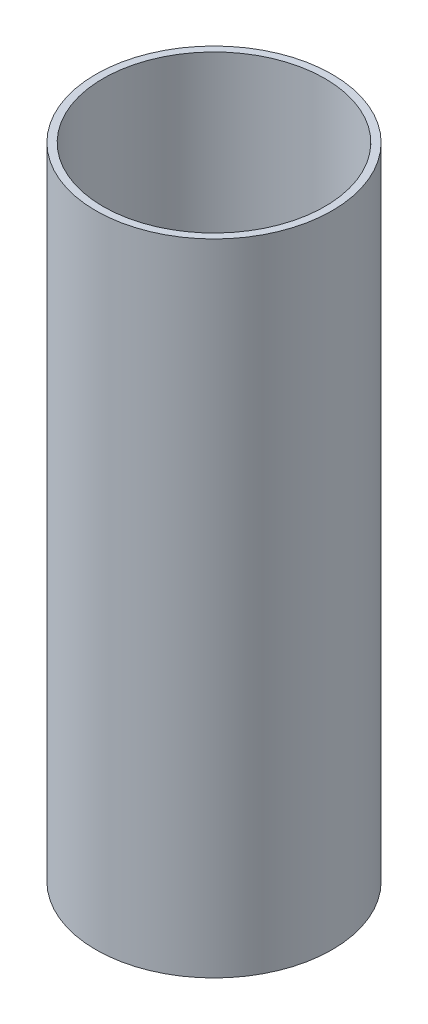
ISO-10303-21;
HEADER;
FILE_DESCRIPTION(('STEP AP214'),'2;1');
FILE_NAME('part.step','',(''),(''),'','','');
FILE_SCHEMA(('AUTOMOTIVE_DESIGN { 1 0 10303 214 1 1 1 1 }'));
ENDSEC;
DATA;
#1=APPLICATION_CONTEXT('core data for automotive mechanical design processes');
#2=APPLICATION_PROTOCOL_DEFINITION('international standard','automotive_design',2000,#1);
#3=PRODUCT_CONTEXT('',#1,'mechanical');
#4=PRODUCT('Part','Part','',(#3));
#5=PRODUCT_RELATED_PRODUCT_CATEGORY('part','',(#4));
#6=PRODUCT_DEFINITION_FORMATION('','',#4);
#7=PRODUCT_DEFINITION_CONTEXT('part definition',#1,'design');
#8=PRODUCT_DEFINITION('design','',#6,#7);
#9=PRODUCT_DEFINITION_SHAPE('','',#8);
#10=(LENGTH_UNIT() NAMED_UNIT(*) SI_UNIT(.MILLI.,.METRE.));
#11=(NAMED_UNIT(*) PLANE_ANGLE_UNIT() SI_UNIT($,.RADIAN.));
#12=(NAMED_UNIT(*) SI_UNIT($,.STERADIAN.) SOLID_ANGLE_UNIT());
#13=UNCERTAINTY_MEASURE_WITH_UNIT(LENGTH_MEASURE(1.E-05),#10,'distance_accuracy_value','');
#14=(GEOMETRIC_REPRESENTATION_CONTEXT(3) GLOBAL_UNCERTAINTY_ASSIGNED_CONTEXT((#13)) GLOBAL_UNIT_ASSIGNED_CONTEXT((#10,
#11,#12)) REPRESENTATION_CONTEXT('',''));
#15=CARTESIAN_POINT('',(0.,0.,0.));
#16=DIRECTION('',(0.,0.,1.));
#17=DIRECTION('',(1.,0.,0.));
#18=AXIS2_PLACEMENT_3D('',#15,#16,#17);
#19=CARTESIAN_POINT('',(0.,-13.97,0.));
#20=DIRECTION('',(0.,-1.,0.));
#21=DIRECTION('',(0.,0.,-1.));
#22=AXIS2_PLACEMENT_3D('',#19,#20,#21);
#23=CYLINDRICAL_SURFACE('',#22,48.41875);
#24=CARTESIAN_POINT('',(0.,0.,0.));
#25=DIRECTION('',(0.,-1.,0.));
#26=DIRECTION('',(0.,0.,-1.));
#27=AXIS2_PLACEMENT_3D('',#24,#25,#26);
#28=CIRCLE('',#27,48.41875);
#29=CARTESIAN_POINT('',(0.,0.,-48.41875));
#30=VERTEX_POINT('',#29);
#31=EDGE_CURVE('E50',#30,#30,#28,.T.);
#32=ORIENTED_EDGE('',*,*,#31,.T.);
#33=EDGE_LOOP('',(#32));
#34=FACE_BOUND('',#33,.T.);
#35=CARTESIAN_POINT('',(0.,279.4,0.));
#36=DIRECTION('',(0.,-1.,0.));
#37=DIRECTION('',(0.,0.,-1.));
#38=AXIS2_PLACEMENT_3D('',#35,#36,#37);
#39=CIRCLE('',#38,48.41875);
#40=CARTESIAN_POINT('',(0.,279.4,-48.41875));
#41=VERTEX_POINT('',#40);
#42=EDGE_CURVE('E10',#41,#41,#39,.T.);
#43=ORIENTED_EDGE('',*,*,#42,.F.);
#44=EDGE_LOOP('',(#43));
#45=FACE_BOUND('',#44,.T.);
#46=ADVANCED_FACE('F36',(#34,#45),#23,.F.);
#47=CARTESIAN_POINT('',(48.41875,279.4,0.));
#48=DIRECTION('',(0.,1.,0.));
#49=DIRECTION('',(0.,0.,1.));
#50=AXIS2_PLACEMENT_3D('',#47,#48,#49);
#51=PLANE('',#50);
#52=ORIENTED_EDGE('',*,*,#42,.T.);
#53=EDGE_LOOP('',(#52));
#54=FACE_BOUND('',#53,.T.);
#55=CARTESIAN_POINT('',(0.,279.4,0.));
#56=DIRECTION('',(0.,-1.,0.));
#57=DIRECTION('',(0.,0.,-1.));
#58=AXIS2_PLACEMENT_3D('',#55,#56,#57);
#59=CIRCLE('',#58,51.59375);
#60=CARTESIAN_POINT('',(0.,279.4,-51.59375));
#61=VERTEX_POINT('',#60);
#62=EDGE_CURVE('E42',#61,#61,#59,.T.);
#63=ORIENTED_EDGE('',*,*,#62,.F.);
#64=EDGE_LOOP('',(#63));
#65=FACE_BOUND('',#64,.T.);
#66=ADVANCED_FACE('F66',(#54,#65),#51,.T.);
#67=CARTESIAN_POINT('',(0.,-13.97,0.));
#68=DIRECTION('',(0.,-1.,0.));
#69=DIRECTION('',(0.,0.,-1.));
#70=AXIS2_PLACEMENT_3D('',#67,#68,#69);
#71=CYLINDRICAL_SURFACE('',#70,51.59375);
#72=ORIENTED_EDGE('',*,*,#62,.T.);
#73=EDGE_LOOP('',(#72));
#74=FACE_BOUND('',#73,.T.);
#75=CARTESIAN_POINT('',(0.,0.,0.));
#76=DIRECTION('',(0.,-1.,0.));
#77=DIRECTION('',(0.,0.,-1.));
#78=AXIS2_PLACEMENT_3D('',#75,#76,#77);
#79=CIRCLE('',#78,51.59375);
#80=CARTESIAN_POINT('',(0.,0.,-51.59375));
#81=VERTEX_POINT('',#80);
#82=EDGE_CURVE('E46',#81,#81,#79,.T.);
#83=ORIENTED_EDGE('',*,*,#82,.F.);
#84=EDGE_LOOP('',(#83));
#85=FACE_BOUND('',#84,.T.);
#86=ADVANCED_FACE('F60',(#74,#85),#71,.T.);
#87=CARTESIAN_POINT('',(48.41875,0.,0.));
#88=DIRECTION('',(0.,-1.,0.));
#89=DIRECTION('',(0.,0.,-1.));
#90=AXIS2_PLACEMENT_3D('',#87,#88,#89);
#91=PLANE('',#90);
#92=ORIENTED_EDGE('',*,*,#82,.T.);
#93=EDGE_LOOP('',(#92));
#94=FACE_BOUND('',#93,.T.);
#95=ORIENTED_EDGE('',*,*,#31,.F.);
#96=EDGE_LOOP('',(#95));
#97=FACE_BOUND('',#96,.T.);
#98=ADVANCED_FACE('F58',(#94,#97),#91,.T.);
#99=CLOSED_SHELL('',(#46,#66,#86,#98));
#100=MANIFOLD_SOLID_BREP('B2',#99);
#101=ADVANCED_BREP_SHAPE_REPRESENTATION('',(#18,#100),#14);
#102=SHAPE_DEFINITION_REPRESENTATION(#9,#101);
ENDSEC;
END-ISO-10303-21;
